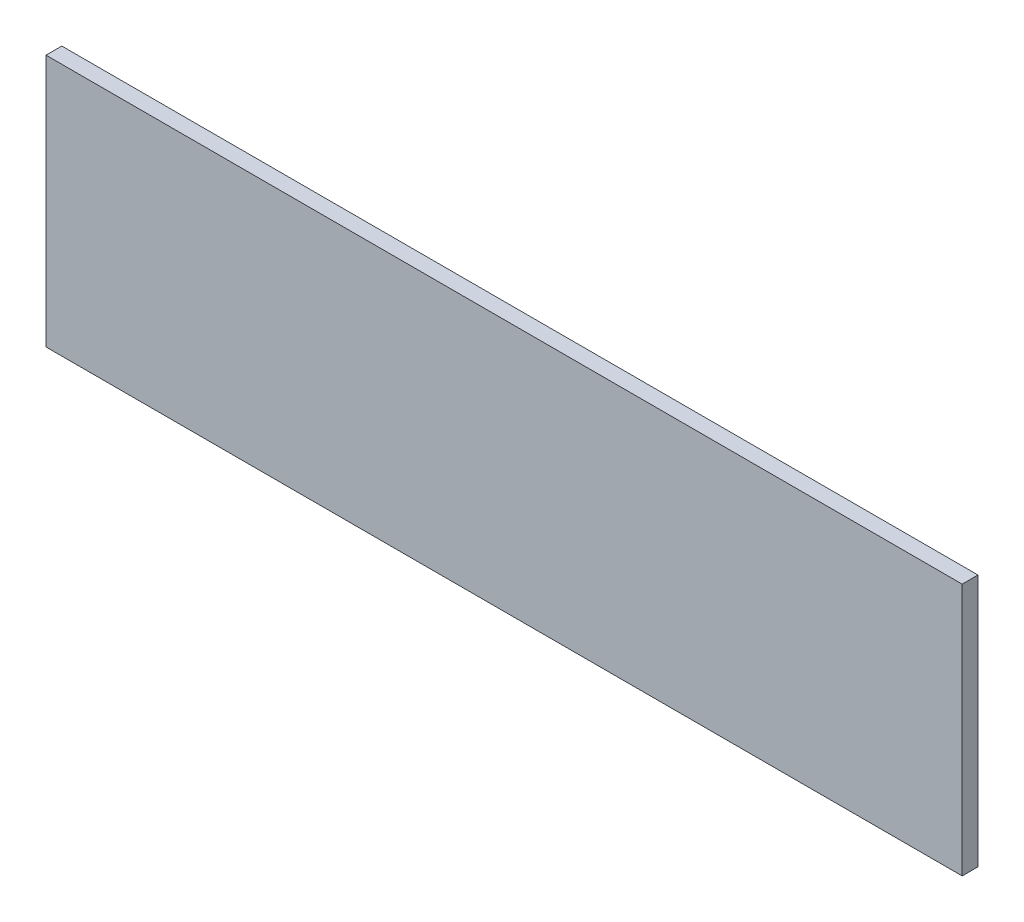
ISO-10303-21;
HEADER;
FILE_DESCRIPTION(('STEP AP214'),'2;1');
FILE_NAME('part.step','',(''),(''),'','','');
FILE_SCHEMA(('AUTOMOTIVE_DESIGN { 1 0 10303 214 1 1 1 1 }'));
ENDSEC;
DATA;
#1=APPLICATION_CONTEXT('core data for automotive mechanical design processes');
#2=APPLICATION_PROTOCOL_DEFINITION('international standard','automotive_design',2000,#1);
#3=PRODUCT_CONTEXT('',#1,'mechanical');
#4=PRODUCT('Part','Part','',(#3));
#5=PRODUCT_RELATED_PRODUCT_CATEGORY('part','',(#4));
#6=PRODUCT_DEFINITION_FORMATION('','',#4);
#7=PRODUCT_DEFINITION_CONTEXT('part definition',#1,'design');
#8=PRODUCT_DEFINITION('design','',#6,#7);
#9=PRODUCT_DEFINITION_SHAPE('','',#8);
#10=(LENGTH_UNIT() NAMED_UNIT(*) SI_UNIT(.MILLI.,.METRE.));
#11=(NAMED_UNIT(*) PLANE_ANGLE_UNIT() SI_UNIT($,.RADIAN.));
#12=(NAMED_UNIT(*) SI_UNIT($,.STERADIAN.) SOLID_ANGLE_UNIT());
#13=UNCERTAINTY_MEASURE_WITH_UNIT(LENGTH_MEASURE(1.E-05),#10,'distance_accuracy_value','');
#14=(GEOMETRIC_REPRESENTATION_CONTEXT(3) GLOBAL_UNCERTAINTY_ASSIGNED_CONTEXT((#13)) GLOBAL_UNIT_ASSIGNED_CONTEXT((#10,
#11,#12)) REPRESENTATION_CONTEXT('',''));
#15=CARTESIAN_POINT('',(0.,0.,0.));
#16=DIRECTION('',(0.,0.,1.));
#17=DIRECTION('',(1.,0.,0.));
#18=AXIS2_PLACEMENT_3D('',#15,#16,#17);
#19=CARTESIAN_POINT('',(92.075,-25.4,1.5875));
#20=DIRECTION('',(-1.,0.,0.));
#21=DIRECTION('',(0.,0.,1.));
#22=AXIS2_PLACEMENT_3D('',#19,#20,#21);
#23=PLANE('',#22);
#24=DIRECTION('',(0.,1.,0.));
#25=VECTOR('',#24,1.);
#26=CARTESIAN_POINT('',(92.075,-25.4,-1.5875));
#27=LINE('',#26,#25);
#28=CARTESIAN_POINT('',(92.075,-25.4,-1.5875));
#29=VERTEX_POINT('',#28);
#30=CARTESIAN_POINT('',(92.075,25.4,-1.5875));
#31=VERTEX_POINT('',#30);
#32=EDGE_CURVE('E107',#29,#31,#27,.T.);
#33=ORIENTED_EDGE('',*,*,#32,.T.);
#34=DIRECTION('',(0.,0.,-1.));
#35=VECTOR('',#34,1.);
#36=CARTESIAN_POINT('',(92.075,25.4,1.5875));
#37=LINE('',#36,#35);
#38=CARTESIAN_POINT('',(92.075,25.4,1.5875));
#39=VERTEX_POINT('',#38);
#40=EDGE_CURVE('E11',#39,#31,#37,.T.);
#41=ORIENTED_EDGE('',*,*,#40,.F.);
#42=DIRECTION('',(0.,1.,0.));
#43=VECTOR('',#42,1.);
#44=CARTESIAN_POINT('',(92.075,-25.4,1.5875));
#45=LINE('',#44,#43);
#46=CARTESIAN_POINT('',(92.075,-25.4,1.5875));
#47=VERTEX_POINT('',#46);
#48=EDGE_CURVE('E91',#47,#39,#45,.T.);
#49=ORIENTED_EDGE('',*,*,#48,.F.);
#50=DIRECTION('',(0.,0.,-1.));
#51=VECTOR('',#50,1.);
#52=CARTESIAN_POINT('',(92.075,-25.4,1.5875));
#53=LINE('',#52,#51);
#54=EDGE_CURVE('E103',#47,#29,#53,.T.);
#55=ORIENTED_EDGE('',*,*,#54,.T.);
#56=EDGE_LOOP('',(#33,#41,#49,#55));
#57=FACE_BOUND('',#56,.T.);
#58=ADVANCED_FACE('F39',(#57),#23,.F.);
#59=CARTESIAN_POINT('',(-92.075,25.4,1.5875));
#60=DIRECTION('',(0.,-1.,0.));
#61=DIRECTION('',(0.,0.,-1.));
#62=AXIS2_PLACEMENT_3D('',#59,#60,#61);
#63=PLANE('',#62);
#64=DIRECTION('',(-1.,0.,0.));
#65=VECTOR('',#64,1.);
#66=CARTESIAN_POINT('',(-92.075,25.4,-1.5875));
#67=LINE('',#66,#65);
#68=CARTESIAN_POINT('',(-92.075,25.4,-1.5875));
#69=VERTEX_POINT('',#68);
#70=EDGE_CURVE('E96',#31,#69,#67,.T.);
#71=ORIENTED_EDGE('',*,*,#70,.T.);
#72=DIRECTION('',(0.,0.,-1.));
#73=VECTOR('',#72,1.);
#74=CARTESIAN_POINT('',(-92.075,25.4,1.5875));
#75=LINE('',#74,#73);
#76=CARTESIAN_POINT('',(-92.075,25.4,1.5875));
#77=VERTEX_POINT('',#76);
#78=EDGE_CURVE('E48',#77,#69,#75,.T.);
#79=ORIENTED_EDGE('',*,*,#78,.F.);
#80=DIRECTION('',(-1.,0.,0.));
#81=VECTOR('',#80,1.);
#82=CARTESIAN_POINT('',(-92.075,25.4,1.5875));
#83=LINE('',#82,#81);
#84=EDGE_CURVE('E86',#39,#77,#83,.T.);
#85=ORIENTED_EDGE('',*,*,#84,.F.);
#86=ORIENTED_EDGE('',*,*,#40,.T.);
#87=EDGE_LOOP('',(#71,#79,#85,#86));
#88=FACE_BOUND('',#87,.T.);
#89=ADVANCED_FACE('F95',(#88),#63,.F.);
#90=CARTESIAN_POINT('',(-92.075,-25.4,1.5875));
#91=DIRECTION('',(1.,0.,0.));
#92=DIRECTION('',(0.,0.,-1.));
#93=AXIS2_PLACEMENT_3D('',#90,#91,#92);
#94=PLANE('',#93);
#95=DIRECTION('',(0.,-1.,0.));
#96=VECTOR('',#95,1.);
#97=CARTESIAN_POINT('',(-92.075,-25.4,-1.5875));
#98=LINE('',#97,#96);
#99=CARTESIAN_POINT('',(-92.075,-25.4,-1.5875));
#100=VERTEX_POINT('',#99);
#101=EDGE_CURVE('E73',#69,#100,#98,.T.);
#102=ORIENTED_EDGE('',*,*,#101,.T.);
#103=DIRECTION('',(0.,0.,-1.));
#104=VECTOR('',#103,1.);
#105=CARTESIAN_POINT('',(-92.075,-25.4,1.5875));
#106=LINE('',#105,#104);
#107=CARTESIAN_POINT('',(-92.075,-25.4,1.5875));
#108=VERTEX_POINT('',#107);
#109=EDGE_CURVE('E98',#108,#100,#106,.T.);
#110=ORIENTED_EDGE('',*,*,#109,.F.);
#111=DIRECTION('',(0.,-1.,0.));
#112=VECTOR('',#111,1.);
#113=CARTESIAN_POINT('',(-92.075,-25.4,1.5875));
#114=LINE('',#113,#112);
#115=EDGE_CURVE('E89',#77,#108,#114,.T.);
#116=ORIENTED_EDGE('',*,*,#115,.F.);
#117=ORIENTED_EDGE('',*,*,#78,.T.);
#118=EDGE_LOOP('',(#102,#110,#116,#117));
#119=FACE_BOUND('',#118,.T.);
#120=ADVANCED_FACE('F99',(#119),#94,.F.);
#121=CARTESIAN_POINT('',(-92.075,-25.4,1.5875));
#122=DIRECTION('',(0.,1.,0.));
#123=DIRECTION('',(0.,0.,1.));
#124=AXIS2_PLACEMENT_3D('',#121,#122,#123);
#125=PLANE('',#124);
#126=DIRECTION('',(1.,0.,0.));
#127=VECTOR('',#126,1.);
#128=CARTESIAN_POINT('',(-92.075,-25.4,-1.5875));
#129=LINE('',#128,#127);
#130=EDGE_CURVE('E79',#100,#29,#129,.T.);
#131=ORIENTED_EDGE('',*,*,#130,.T.);
#132=ORIENTED_EDGE('',*,*,#54,.F.);
#133=DIRECTION('',(1.,0.,0.));
#134=VECTOR('',#133,1.);
#135=CARTESIAN_POINT('',(-92.075,-25.4,1.5875));
#136=LINE('',#135,#134);
#137=EDGE_CURVE('E56',#108,#47,#136,.T.);
#138=ORIENTED_EDGE('',*,*,#137,.F.);
#139=ORIENTED_EDGE('',*,*,#109,.T.);
#140=EDGE_LOOP('',(#131,#132,#138,#139));
#141=FACE_BOUND('',#140,.T.);
#142=ADVANCED_FACE('F120',(#141),#125,.F.);
#143=CARTESIAN_POINT('',(0.,0.,1.5875));
#144=DIRECTION('',(0.,0.,-1.));
#145=DIRECTION('',(-1.,0.,0.));
#146=AXIS2_PLACEMENT_3D('',#143,#144,#145);
#147=PLANE('',#146);
#148=ORIENTED_EDGE('',*,*,#48,.T.);
#149=ORIENTED_EDGE('',*,*,#84,.T.);
#150=ORIENTED_EDGE('',*,*,#115,.T.);
#151=ORIENTED_EDGE('',*,*,#137,.T.);
#152=EDGE_LOOP('',(#148,#149,#150,#151));
#153=FACE_BOUND('',#152,.T.);
#154=ADVANCED_FACE('F87',(#153),#147,.F.);
#155=CARTESIAN_POINT('',(0.,0.,-1.5875));
#156=DIRECTION('',(0.,0.,-1.));
#157=DIRECTION('',(-1.,0.,0.));
#158=AXIS2_PLACEMENT_3D('',#155,#156,#157);
#159=PLANE('',#158);
#160=ORIENTED_EDGE('',*,*,#32,.F.);
#161=ORIENTED_EDGE('',*,*,#130,.F.);
#162=ORIENTED_EDGE('',*,*,#101,.F.);
#163=ORIENTED_EDGE('',*,*,#70,.F.);
#164=EDGE_LOOP('',(#160,#161,#162,#163));
#165=FACE_BOUND('',#164,.T.);
#166=ADVANCED_FACE('F123',(#165),#159,.T.);
#167=CLOSED_SHELL('',(#58,#89,#120,#142,#154,#166));
#168=MANIFOLD_SOLID_BREP('B2',#167);
#169=ADVANCED_BREP_SHAPE_REPRESENTATION('',(#18,#168),#14);
#170=SHAPE_DEFINITION_REPRESENTATION(#9,#169);
ENDSEC;
END-ISO-10303-21;
